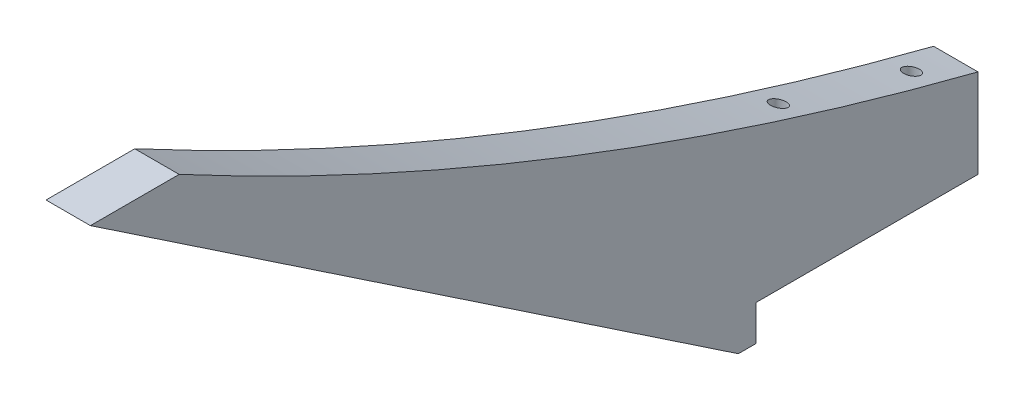
ISO-10303-21;
HEADER;
FILE_DESCRIPTION(('STEP AP214'),'2;1');
FILE_NAME('part.step','',(''),(''),'','','');
FILE_SCHEMA(('AUTOMOTIVE_DESIGN { 1 0 10303 214 1 1 1 1 }'));
ENDSEC;
DATA;
#1=APPLICATION_CONTEXT('core data for automotive mechanical design processes');
#2=APPLICATION_PROTOCOL_DEFINITION('international standard','automotive_design',2000,#1);
#3=PRODUCT_CONTEXT('',#1,'mechanical');
#4=PRODUCT('Part','Part','',(#3));
#5=PRODUCT_RELATED_PRODUCT_CATEGORY('part','',(#4));
#6=PRODUCT_DEFINITION_FORMATION('','',#4);
#7=PRODUCT_DEFINITION_CONTEXT('part definition',#1,'design');
#8=PRODUCT_DEFINITION('design','',#6,#7);
#9=PRODUCT_DEFINITION_SHAPE('','',#8);
#10=(LENGTH_UNIT() NAMED_UNIT(*) SI_UNIT(.MILLI.,.METRE.));
#11=(NAMED_UNIT(*) PLANE_ANGLE_UNIT() SI_UNIT($,.RADIAN.));
#12=(NAMED_UNIT(*) SI_UNIT($,.STERADIAN.) SOLID_ANGLE_UNIT());
#13=UNCERTAINTY_MEASURE_WITH_UNIT(LENGTH_MEASURE(1.E-05),#10,'distance_accuracy_value','');
#14=(GEOMETRIC_REPRESENTATION_CONTEXT(3) GLOBAL_UNCERTAINTY_ASSIGNED_CONTEXT((#13)) GLOBAL_UNIT_ASSIGNED_CONTEXT((#10,
#11,#12)) REPRESENTATION_CONTEXT('',''));
#15=CARTESIAN_POINT('',(0.,0.,0.));
#16=DIRECTION('',(0.,0.,1.));
#17=DIRECTION('',(1.,0.,0.));
#18=AXIS2_PLACEMENT_3D('',#15,#16,#17);
#19=CARTESIAN_POINT('',(6.35,0.,0.));
#20=DIRECTION('',(0.,1.,0.));
#21=DIRECTION('',(0.,0.,1.));
#22=AXIS2_PLACEMENT_3D('',#19,#20,#21);
#23=PLANE('',#22);
#24=CARTESIAN_POINT('',(3.175,0.,25.4));
#25=DIRECTION('',(0.,-1.,0.));
#26=DIRECTION('',(0.,0.,-1.));
#27=AXIS2_PLACEMENT_3D('',#24,#25,#26);
#28=CIRCLE('',#27,1.1303);
#29=CARTESIAN_POINT('',(3.175,0.,24.2697));
#30=VERTEX_POINT('',#29);
#31=EDGE_CURVE('E227',#30,#30,#28,.T.);
#32=ORIENTED_EDGE('',*,*,#31,.F.);
#33=EDGE_LOOP('',(#32));
#34=FACE_BOUND('',#33,.T.);
#35=CARTESIAN_POINT('',(3.175,0.,6.35));
#36=DIRECTION('',(0.,-1.,0.));
#37=DIRECTION('',(0.,0.,-1.));
#38=AXIS2_PLACEMENT_3D('',#35,#36,#37);
#39=CIRCLE('',#38,1.1303);
#40=CARTESIAN_POINT('',(3.175,0.,5.2197));
#41=VERTEX_POINT('',#40);
#42=EDGE_CURVE('E208',#41,#41,#39,.T.);
#43=ORIENTED_EDGE('',*,*,#42,.F.);
#44=EDGE_LOOP('',(#43));
#45=FACE_BOUND('',#44,.T.);
#46=DIRECTION('',(0.,0.,-1.));
#47=VECTOR('',#46,1.);
#48=CARTESIAN_POINT('',(0.,0.,0.));
#49=LINE('',#48,#47);
#50=CARTESIAN_POINT('',(0.,0.,31.75));
#51=VERTEX_POINT('',#50);
#52=CARTESIAN_POINT('',(0.,0.,0.));
#53=VERTEX_POINT('',#52);
#54=EDGE_CURVE('E149',#51,#53,#49,.T.);
#55=ORIENTED_EDGE('',*,*,#54,.T.);
#56=DIRECTION('',(-1.,0.,0.));
#57=VECTOR('',#56,1.);
#58=CARTESIAN_POINT('',(6.35,0.,0.));
#59=LINE('',#58,#57);
#60=CARTESIAN_POINT('',(6.35,0.,0.));
#61=VERTEX_POINT('',#60);
#62=EDGE_CURVE('E11',#61,#53,#59,.T.);
#63=ORIENTED_EDGE('',*,*,#62,.F.);
#64=DIRECTION('',(0.,0.,-1.));
#65=VECTOR('',#64,1.);
#66=CARTESIAN_POINT('',(6.35,0.,0.));
#67=LINE('',#66,#65);
#68=CARTESIAN_POINT('',(6.35,0.,31.75));
#69=VERTEX_POINT('',#68);
#70=EDGE_CURVE('E169',#69,#61,#67,.T.);
#71=ORIENTED_EDGE('',*,*,#70,.F.);
#72=DIRECTION('',(-1.,0.,0.));
#73=VECTOR('',#72,1.);
#74=CARTESIAN_POINT('',(6.35,0.,31.75));
#75=LINE('',#74,#73);
#76=EDGE_CURVE('E145',#69,#51,#75,.T.);
#77=ORIENTED_EDGE('',*,*,#76,.T.);
#78=EDGE_LOOP('',(#55,#63,#71,#77));
#79=FACE_BOUND('',#78,.T.);
#80=ADVANCED_FACE('F40',(#34,#45,#79),#23,.F.);
#81=CARTESIAN_POINT('',(6.35,0.,0.));
#82=DIRECTION('',(0.,0.,1.));
#83=DIRECTION('',(1.,0.,0.));
#84=AXIS2_PLACEMENT_3D('',#81,#82,#83);
#85=PLANE('',#84);
#86=DIRECTION('',(0.,1.,0.));
#87=VECTOR('',#86,1.);
#88=CARTESIAN_POINT('',(0.,0.,0.));
#89=LINE('',#88,#87);
#90=CARTESIAN_POINT('',(0.,12.7,0.));
#91=VERTEX_POINT('',#90);
#92=EDGE_CURVE('E153',#53,#91,#89,.T.);
#93=ORIENTED_EDGE('',*,*,#92,.T.);
#94=DIRECTION('',(-1.,0.,0.));
#95=VECTOR('',#94,1.);
#96=CARTESIAN_POINT('',(6.35,12.7,0.));
#97=LINE('',#96,#95);
#98=CARTESIAN_POINT('',(6.35,12.7,0.));
#99=VERTEX_POINT('',#98);
#100=EDGE_CURVE('E49',#99,#91,#97,.T.);
#101=ORIENTED_EDGE('',*,*,#100,.F.);
#102=DIRECTION('',(0.,1.,0.));
#103=VECTOR('',#102,1.);
#104=CARTESIAN_POINT('',(6.35,0.,0.));
#105=LINE('',#104,#103);
#106=EDGE_CURVE('E108',#61,#99,#105,.T.);
#107=ORIENTED_EDGE('',*,*,#106,.F.);
#108=ORIENTED_EDGE('',*,*,#62,.T.);
#109=EDGE_LOOP('',(#93,#101,#107,#108));
#110=FACE_BOUND('',#109,.T.);
#111=ADVANCED_FACE('F235',(#110),#85,.F.);
#112=CARTESIAN_POINT('',(6.35,504.92149849674,-125.626416082065));
#113=DIRECTION('',(-1.,0.,0.));
#114=DIRECTION('',(0.,0.,1.));
#115=AXIS2_PLACEMENT_3D('',#112,#113,#114);
#116=CYLINDRICAL_SURFACE('',#115,508.);
#117=CARTESIAN_POINT('',(3.175,19.5400460456678,24.2697));
#118=CARTESIAN_POINT('',(3.23639612715432,19.5400469844557,24.2697030750058));
#119=CARTESIAN_POINT('',(3.29783934554121,19.541597215755,24.2747231588741));
#120=CARTESIAN_POINT('',(3.41899634932948,19.5477484189346,24.2946392750987));
#121=CARTESIAN_POINT('',(3.47870786875294,19.5523532150549,24.3095476873962));
#122=CARTESIAN_POINT('',(3.59458670419996,19.5644456180739,24.3486873086587));
#123=CARTESIAN_POINT('',(3.6507589143203,19.5719291377724,24.3729052998872));
#124=CARTESIAN_POINT('',(3.75814103806556,19.5895274040101,24.4298357658817));
#125=CARTESIAN_POINT('',(3.80935182054985,19.599641688695,24.4625467496248));
#126=CARTESIAN_POINT('',(3.90648654511878,19.6224009539825,24.5361206253703));
#127=CARTESIAN_POINT('',(3.95229151957283,19.6350903756224,24.5771266241642));
#128=CARTESIAN_POINT('',(4.03640250990635,19.6624936311897,24.6656340754641));
#129=CARTESIAN_POINT('',(4.07470695701011,19.6772078875289,24.7131368832916));
#130=CARTESIAN_POINT('',(4.14444965569178,19.708908486545,24.8154181142534));
#131=CARTESIAN_POINT('',(4.17552998890056,19.7259645025125,24.8704189575477));
#132=CARTESIAN_POINT('',(4.22802322146617,19.7613558308319,24.9844717508056));
#133=CARTESIAN_POINT('',(4.24943402448206,19.7796914195997,25.0435245760398));
#134=CARTESIAN_POINT('',(4.28285424085325,19.8179358540818,25.1666136951452));
#135=CARTESIAN_POINT('',(4.29443875983532,19.8378784009851,25.2307550813693));
#136=CARTESIAN_POINT('',(4.30645439267016,19.8780847793138,25.3599786372956));
#137=CARTESIAN_POINT('',(4.30688370470151,19.8983486621133,25.4250609572817));
#138=CARTESIAN_POINT('',(4.29645926865756,19.9391265819884,25.5559365174312));
#139=CARTESIAN_POINT('',(4.28533996879878,19.9596352968425,25.6217104886801));
#140=CARTESIAN_POINT('',(4.25163496426418,19.9998281384269,25.7505246047472));
#141=CARTESIAN_POINT('',(4.22904891242653,20.019512240172,25.8135646667322));
#142=CARTESIAN_POINT('',(4.17305195343334,20.0573588526642,25.9346940182318));
#143=CARTESIAN_POINT('',(4.13970072660411,20.0755290730681,25.9928084224015));
#144=CARTESIAN_POINT('',(4.06291427756319,20.1098820062374,26.1026181510082));
#145=CARTESIAN_POINT('',(4.0194807245118,20.126065047309,26.1543145357962));
#146=CARTESIAN_POINT('',(3.92525917684202,20.1553780425239,26.2479095633626));
#147=CARTESIAN_POINT('',(3.87476559817445,20.1685919790607,26.2900779811955));
#148=CARTESIAN_POINT('',(3.76677063525675,20.1921568823209,26.3652512402119));
#149=CARTESIAN_POINT('',(3.70927131126085,20.2025086878281,26.3982587661218));
#150=CARTESIAN_POINT('',(3.59176801641056,20.219541947255,26.452557129099));
#151=CARTESIAN_POINT('',(3.53200344128625,20.2263712062098,26.4743198787969));
#152=CARTESIAN_POINT('',(3.40940977111788,20.236799330916,26.5075469305158));
#153=CARTESIAN_POINT('',(3.34658144702549,20.2403990049718,26.5190138094003));
#154=CARTESIAN_POINT('',(3.22213500445964,20.2441560666382,26.5309819379177));
#155=CARTESIAN_POINT('',(3.1605576343483,20.2444354408429,26.5318717840089));
#156=CARTESIAN_POINT('',(3.03814388087101,20.2418573572667,26.5236594458072));
#157=CARTESIAN_POINT('',(2.97730742762761,20.239000197652,26.5145582112896));
#158=CARTESIAN_POINT('',(2.85874370732265,20.230301467482,26.4868434579953));
#159=CARTESIAN_POINT('',(2.80099068046895,20.2244912509741,26.4683298741321));
#160=CARTESIAN_POINT('',(2.68947211590311,20.2101079170194,26.4224853151399));
#161=CARTESIAN_POINT('',(2.63570683180548,20.20153462403,26.3951537797928));
#162=CARTESIAN_POINT('',(2.53252193584346,20.1817167859637,26.3319503897877));
#163=CARTESIAN_POINT('',(2.4832074456827,20.1704234343763,26.2959224649975));
#164=CARTESIAN_POINT('',(2.39131032293476,20.1456192764607,26.2167551303329));
#165=CARTESIAN_POINT('',(2.34872886436275,20.1321080842507,26.1736144829109));
#166=CARTESIAN_POINT('',(2.26967035405138,20.1026843497833,26.0796153259484));
#167=CARTESIAN_POINT('',(2.23350684202407,20.0866972005588,26.0285165748318));
#168=CARTESIAN_POINT('',(2.17023768762965,20.053217192412,25.9214408179157));
#169=CARTESIAN_POINT('',(2.14313400843095,20.0357240081794,25.8654627581311));
#170=CARTESIAN_POINT('',(2.09753108435376,19.9989071238161,25.7475722726311));
#171=CARTESIAN_POINT('',(2.07946432852618,19.9795367104465,25.6855069789182));
#172=CARTESIAN_POINT('',(2.05414644546433,19.9402028376154,25.5593875698501));
#173=CARTESIAN_POINT('',(2.04689736992107,19.9202392663872,25.495333079573));
#174=CARTESIAN_POINT('',(2.04330729591169,19.8796501647492,25.3650080451524));
#175=CARTESIAN_POINT('',(2.0472999046309,19.8590227352566,25.2987286455948));
#176=CARTESIAN_POINT('',(2.06684227772061,19.8182813614719,25.1677264858806));
#177=CARTESIAN_POINT('',(2.08239286537524,19.7981674538638,25.1030038369518));
#178=CARTESIAN_POINT('',(2.12479190793595,19.7589793433618,24.9768188987375));
#179=CARTESIAN_POINT('',(2.15167009977313,19.7399080274097,24.9153656739764));
#180=CARTESIAN_POINT('',(2.21613265351429,19.7034457900573,24.7978011117236));
#181=CARTESIAN_POINT('',(2.25371539414706,19.6860546147229,24.7416889670075));
#182=CARTESIAN_POINT('',(2.33752114964153,19.6539586805389,24.6380762941615));
#183=CARTESIAN_POINT('',(2.38348537805544,19.6391943783038,24.5903851538279));
#184=CARTESIAN_POINT('',(2.48350084804306,19.612293988269,24.5034546818269));
#185=CARTESIAN_POINT('',(2.53755211533365,19.6001579088273,24.4642153770376));
#186=CARTESIAN_POINT('',(2.64965986668999,19.5794271850591,24.3971653869279));
#187=CARTESIAN_POINT('',(2.70743907445983,19.5707012329773,24.3689310984138));
#188=CARTESIAN_POINT('',(2.82723587853125,19.5563913642847,24.3226198358436));
#189=CARTESIAN_POINT('',(2.88924650220618,19.550802412283,24.3045265838552));
#190=CARTESIAN_POINT('',(2.98897023558641,19.5446128887764,24.2844873606096));
#191=CARTESIAN_POINT('',(3.02593178733565,19.5429029026555,24.2789505802527));
#192=CARTESIAN_POINT('',(3.10025641283926,19.5406192069743,24.2715560016033));
#193=CARTESIAN_POINT('',(3.1376194783375,19.5400454740946,24.2696981278083));
#194=CARTESIAN_POINT('',(3.175,19.5400460456678,24.2697));
#195=B_SPLINE_CURVE_WITH_KNOTS('',3,(#117,#118,#119,#120,#121,#122,#123,#124,#125,#126,#127,
#128,#129,#130,#131,#132,#133,#134,#135,#136,#137,#138,#139,#140,#141,#142,#143,#144,#145,#146,
#147,#148,#149,#150,#151,#152,#153,#154,#155,#156,#157,#158,#159,#160,#161,#162,#163,#164,#165,
#166,#167,#168,#169,#170,#171,#172,#173,#174,#175,#176,#177,#178,#179,#180,#181,#182,#183,#184,
#185,#186,#187,#188,#189,#190,#191,#192,#193,#194),.UNSPECIFIED.,.T.,.F.,(4,2,2,2,2,2,2,2,2,2,2,
2,2,2,2,2,2,2,2,2,2,2,2,2,2,2,2,2,2,2,2,2,2,2,2,2,2,2,4),(0.,0.184048414185326,
0.368327688449311,0.552346283710007,0.736332594636358,0.92381542308732,1.11133742279507,
1.30677193780733,1.50224880243991,1.7058005553657,1.90938518635759,2.1177569880971,
2.32613509877669,2.5333772851977,2.7405851864718,2.94086578110053,3.14108761859889,
3.33203484183101,3.52293426121778,3.70679744963743,3.89064316111017,4.07257644573625,
4.25452129114449,4.4400122773379,4.6255355713638,4.81850383656876,5.01151388885793,
5.21304133639889,5.4146070009618,5.6222168047622,5.82984139819311,6.03801447122041,
6.24615603187752,6.44871483426272,6.65127428080113,6.84500446948417,7.0384227940894,
7.15048144097626,7.26253778805025),.UNSPECIFIED.);
#196=CARTESIAN_POINT('',(3.175,19.5400460456678,24.2697));
#197=VERTEX_POINT('',#196);
#198=EDGE_CURVE('E221',#197,#197,#195,.T.);
#199=ORIENTED_EDGE('',*,*,#198,.T.);
#200=EDGE_LOOP('',(#199));
#201=FACE_BOUND('',#200,.T.);
#202=CARTESIAN_POINT('',(3.175,14.0617487654759,5.2197));
#203=CARTESIAN_POINT('',(3.23690057272921,14.0617495569643,5.21970300970408));
#204=CARTESIAN_POINT('',(3.29884768457934,14.0631095000981,5.22480502808711));
#205=CARTESIAN_POINT('',(3.42100756923234,14.0685084081811,5.24505608193283));
#206=CARTESIAN_POINT('',(3.48121810812846,14.0725506761245,5.26021750446593));
#207=CARTESIAN_POINT('',(3.59808608436089,14.0831755988751,5.30005640004546));
#208=CARTESIAN_POINT('',(3.65474765254499,14.0897552339303,5.32472256135697));
#209=CARTESIAN_POINT('',(3.763047127071,14.1052429175371,5.38275976790347));
#210=CARTESIAN_POINT('',(3.81468599173074,14.1141505207184,5.41612914809795));
#211=CARTESIAN_POINT('',(3.91235141887627,14.1341693689653,5.4910849985657));
#212=CARTESIAN_POINT('',(3.95828523965912,14.1453108324132,5.53278411648381));
#213=CARTESIAN_POINT('',(4.04253033465856,14.1693849625917,5.6228324142384));
#214=CARTESIAN_POINT('',(4.08084028898979,14.1823179388226,5.67118274312255));
#215=CARTESIAN_POINT('',(4.15005462708717,14.2100532945516,5.77480350962014));
#216=CARTESIAN_POINT('',(4.1806830961406,14.2249022206149,5.83024576622999));
#217=CARTESIAN_POINT('',(4.23220395803113,14.2557113887389,5.94519522412296));
#218=CARTESIAN_POINT('',(4.25309471595095,14.2716718168991,6.00470310608441));
#219=CARTESIAN_POINT('',(4.28518725935417,14.3047869115674,6.12807725439285));
#220=CARTESIAN_POINT('',(4.29606720945369,14.321963287339,6.19202152792154));
#221=CARTESIAN_POINT('',(4.30676717000689,14.3565727561107,6.32076303734384));
#222=CARTESIAN_POINT('',(4.30658584496782,14.3740058798555,6.38556037528869));
#223=CARTESIAN_POINT('',(4.29506832390168,14.4089534364889,6.51535525574793));
#224=CARTESIAN_POINT('',(4.28353883083692,14.4264640410311,6.58033680039782));
#225=CARTESIAN_POINT('',(4.24929646849296,14.4607547322366,6.70749175964045));
#226=CARTESIAN_POINT('',(4.22658340058628,14.4775348059195,6.76966512433669));
#227=CARTESIAN_POINT('',(4.17063643743311,14.5097882324331,6.88908582953057));
#228=CARTESIAN_POINT('',(4.13745183693324,14.5252672860117,6.94635468379726));
#229=CARTESIAN_POINT('',(4.0613477046095,14.554518959794,7.05451141830854));
#230=CARTESIAN_POINT('',(4.01842937915303,14.5682917911348,7.10540008808061));
#231=CARTESIAN_POINT('',(3.92520522259195,14.5933458566596,7.19792270019034));
#232=CARTESIAN_POINT('',(3.87511537347115,14.6046816133976,7.23975933411294));
#233=CARTESIAN_POINT('',(3.76814663976187,14.6249049920714,7.31436734068615));
#234=CARTESIAN_POINT('',(3.71126919910986,14.6337931333668,7.34714063649316));
#235=CARTESIAN_POINT('',(3.59447641112246,14.6485354979603,7.40148520642644));
#236=CARTESIAN_POINT('',(3.53473631148393,14.654484761056,7.42340744607079));
#237=CARTESIAN_POINT('',(3.41222825818783,14.6635880382149,7.45694703504145));
#238=CARTESIAN_POINT('',(3.34946086715141,14.6667425695834,7.46856629145215));
#239=CARTESIAN_POINT('',(3.22455531011622,14.670093136199,7.48090746400686));
#240=CARTESIAN_POINT('',(3.16244815987886,14.6703689787825,7.48192334304059));
#241=CARTESIAN_POINT('',(3.03895668075853,14.6681601110013,7.47378759560287));
#242=CARTESIAN_POINT('',(2.9775722988366,14.6656756044915,7.46463671995804));
#243=CARTESIAN_POINT('',(2.85776455607114,14.658064737926,7.43659803300875));
#244=CARTESIAN_POINT('',(2.79932150772746,14.6529595741597,7.4177883433241));
#245=CARTESIAN_POINT('',(2.68646832569865,14.640292060621,7.37109967379335));
#246=CARTESIAN_POINT('',(2.63205838702616,14.6327295921258,7.34322025575017));
#247=CARTESIAN_POINT('',(2.52791923228866,14.6152627625876,7.27879948907912));
#248=CARTESIAN_POINT('',(2.47827096485654,14.6053254802082,7.24213635468706));
#249=CARTESIAN_POINT('',(2.38581897054209,14.583481866386,7.16150199905469));
#250=CARTESIAN_POINT('',(2.34301618177295,14.5715752655193,7.11752977784874));
#251=CARTESIAN_POINT('',(2.26406316348995,14.5457519323655,7.02210329749998));
#252=CARTESIAN_POINT('',(2.22815614641266,14.5317848990378,6.97046148658035));
#253=CARTESIAN_POINT('',(2.16549355572164,14.5025348097115,6.86223700492339));
#254=CARTESIAN_POINT('',(2.13873953392278,14.4872515311035,6.8056534984016));
#255=CARTESIAN_POINT('',(2.0942298114499,14.4552603933827,6.6871250568186));
#256=CARTESIAN_POINT('',(2.07680461955633,14.4385219982384,6.62506415487691));
#257=CARTESIAN_POINT('',(2.05272940740905,14.404552108804,6.49901511012122));
#258=CARTESIAN_POINT('',(2.04608094432372,14.3873205436199,6.43502669015356));
#259=CARTESIAN_POINT('',(2.04368049453288,14.3524462801134,6.30542089459344));
#260=CARTESIAN_POINT('',(2.04817450899918,14.3348029731528,6.23979898169199));
#261=CARTESIAN_POINT('',(2.06848489873646,14.2999854829773,6.11019793407714));
#262=CARTESIAN_POINT('',(2.08430182717768,14.2828113227247,6.04621887978222));
#263=CARTESIAN_POINT('',(2.12693333669743,14.2494011369542,5.92166272624584));
#264=CARTESIAN_POINT('',(2.15376306365067,14.2331664386999,5.86109044329442));
#265=CARTESIAN_POINT('',(2.21778162563413,14.2021477206571,5.74527938892978));
#266=CARTESIAN_POINT('',(2.25496915873165,14.1873635188627,5.69003994837503));
#267=CARTESIAN_POINT('',(2.33788255372978,14.1599972001657,5.58772796142958));
#268=CARTESIAN_POINT('',(2.38341642624199,14.1473759437122,5.5405104319468));
#269=CARTESIAN_POINT('',(2.48230737253038,14.124377044299,5.45442754040947));
#270=CARTESIAN_POINT('',(2.53566499422305,14.1139995586022,5.41556276378927));
#271=CARTESIAN_POINT('',(2.64679941365094,14.0961458352466,5.34867448054489));
#272=CARTESIAN_POINT('',(2.70437466803324,14.0885858285108,5.3203380414971));
#273=CARTESIAN_POINT('',(2.82369184746745,14.0761672719424,5.27378025806842));
#274=CARTESIAN_POINT('',(2.8854274110681,14.071304698108,5.25554384663948));
#275=CARTESIAN_POINT('',(2.9855317267343,14.0658387311,5.23504246388594));
#276=CARTESIAN_POINT('',(3.0231729394026,14.0643072052693,5.22929748573932));
#277=CARTESIAN_POINT('',(3.09887023706082,14.0622619874759,5.22162535982344));
#278=CARTESIAN_POINT('',(3.13692631516627,14.0617482786488,5.21969814879703));
#279=CARTESIAN_POINT('',(3.175,14.0617487654759,5.2197));
#280=B_SPLINE_CURVE_WITH_KNOTS('',3,(#202,#203,#204,#205,#206,#207,#208,#209,#210,#211,#212,
#213,#214,#215,#216,#217,#218,#219,#220,#221,#222,#223,#224,#225,#226,#227,#228,#229,#230,#231,
#232,#233,#234,#235,#236,#237,#238,#239,#240,#241,#242,#243,#244,#245,#246,#247,#248,#249,#250,
#251,#252,#253,#254,#255,#256,#257,#258,#259,#260,#261,#262,#263,#264,#265,#266,#267,#268,#269,
#270,#271,#272,#273,#274,#275,#276,#277,#278,#279),.UNSPECIFIED.,.T.,.F.,(4,2,2,2,2,2,2,2,2,2,2,
2,2,2,2,2,2,2,2,2,2,2,2,2,2,2,2,2,2,2,2,2,2,2,2,2,2,2,4),(0.,0.185560107845002,
0.371349138066134,0.556917737441287,0.742450861105251,0.930687418985726,1.11895653710984,
1.31324467145946,1.50756541416141,1.70793488276576,1.90832854320165,2.11219570127761,
2.31606648029617,2.51899150588511,2.72189139531207,2.91962384418203,3.11731430380854,
3.30810684854869,3.49886407017167,3.68431830325068,3.86975884122969,4.05372260080677,
4.23769524977451,4.42438355593017,4.61109742420902,4.80351598140588,4.99596714543432,
5.19484830413082,5.39375819732186,5.59709851257976,5.80044876251426,6.00407962160763,
6.20768489669983,6.40708945605989,6.60650798688998,6.799405997613,6.99201546591663,
7.1061513101511,7.22028526323599),.UNSPECIFIED.);
#281=CARTESIAN_POINT('',(3.175,14.0617487654759,5.2197));
#282=VERTEX_POINT('',#281);
#283=EDGE_CURVE('E154',#282,#282,#280,.T.);
#284=ORIENTED_EDGE('',*,*,#283,.T.);
#285=EDGE_LOOP('',(#284));
#286=FACE_BOUND('',#285,.T.);
#287=CARTESIAN_POINT('',(0.,504.92149849674,-125.626416082065));
#288=DIRECTION('',(-1.,0.,0.));
#289=DIRECTION('',(0.,0.,-1.));
#290=AXIS2_PLACEMENT_3D('',#287,#288,#289);
#291=CIRCLE('',#290,508.);
#292=CARTESIAN_POINT('',(0.,57.15,114.3));
#293=VERTEX_POINT('',#292);
#294=EDGE_CURVE('E157',#91,#293,#291,.T.);
#295=ORIENTED_EDGE('',*,*,#294,.T.);
#296=DIRECTION('',(-1.,0.,0.));
#297=VECTOR('',#296,1.);
#298=CARTESIAN_POINT('',(6.35,57.15,114.3));
#299=LINE('',#298,#297);
#300=CARTESIAN_POINT('',(6.35,57.15,114.3));
#301=VERTEX_POINT('',#300);
#302=EDGE_CURVE('E176',#301,#293,#299,.T.);
#303=ORIENTED_EDGE('',*,*,#302,.F.);
#304=CARTESIAN_POINT('',(6.35,504.92149849674,-125.626416082065));
#305=DIRECTION('',(-1.,0.,0.));
#306=DIRECTION('',(0.,0.,-1.));
#307=AXIS2_PLACEMENT_3D('',#304,#305,#306);
#308=CIRCLE('',#307,508.);
#309=EDGE_CURVE('E186',#99,#301,#308,.T.);
#310=ORIENTED_EDGE('',*,*,#309,.F.);
#311=ORIENTED_EDGE('',*,*,#100,.T.);
#312=EDGE_LOOP('',(#295,#303,#310,#311));
#313=FACE_BOUND('',#312,.T.);
#314=ADVANCED_FACE('F184',(#201,#286,#313),#116,.F.);
#315=CARTESIAN_POINT('',(6.35,57.15,127.));
#316=DIRECTION('',(0.,-1.,0.));
#317=DIRECTION('',(0.,0.,-1.));
#318=AXIS2_PLACEMENT_3D('',#315,#316,#317);
#319=PLANE('',#318);
#320=DIRECTION('',(0.,0.,1.));
#321=VECTOR('',#320,1.);
#322=CARTESIAN_POINT('',(0.,57.15,127.));
#323=LINE('',#322,#321);
#324=CARTESIAN_POINT('',(0.,57.15,127.));
#325=VERTEX_POINT('',#324);
#326=EDGE_CURVE('E160',#293,#325,#323,.T.);
#327=ORIENTED_EDGE('',*,*,#326,.T.);
#328=DIRECTION('',(-1.,0.,0.));
#329=VECTOR('',#328,1.);
#330=CARTESIAN_POINT('',(6.35,57.15,127.));
#331=LINE('',#330,#329);
#332=CARTESIAN_POINT('',(6.35,57.15,127.));
#333=VERTEX_POINT('',#332);
#334=EDGE_CURVE('E138',#333,#325,#331,.T.);
#335=ORIENTED_EDGE('',*,*,#334,.F.);
#336=DIRECTION('',(0.,0.,1.));
#337=VECTOR('',#336,1.);
#338=CARTESIAN_POINT('',(6.35,57.15,127.));
#339=LINE('',#338,#337);
#340=EDGE_CURVE('E127',#301,#333,#339,.T.);
#341=ORIENTED_EDGE('',*,*,#340,.F.);
#342=ORIENTED_EDGE('',*,*,#302,.T.);
#343=EDGE_LOOP('',(#327,#335,#341,#342));
#344=FACE_BOUND('',#343,.T.);
#345=ADVANCED_FACE('F192',(#344),#319,.F.);
#346=CARTESIAN_POINT('',(6.35,-5.08,34.29));
#347=DIRECTION('',(0.,0.830296320178178,-0.557322187516859));
#348=DIRECTION('',(0.,0.557322187516859,0.830296320178178));
#349=AXIS2_PLACEMENT_3D('',#346,#347,#348);
#350=PLANE('',#349);
#351=DIRECTION('',(0.,-0.557322187516859,-0.830296320178178));
#352=VECTOR('',#351,1.);
#353=CARTESIAN_POINT('',(0.,-5.08,34.29));
#354=LINE('',#353,#352);
#355=CARTESIAN_POINT('',(0.,-5.08,34.29));
#356=VERTEX_POINT('',#355);
#357=EDGE_CURVE('E136',#325,#356,#354,.T.);
#358=ORIENTED_EDGE('',*,*,#357,.T.);
#359=DIRECTION('',(-1.,0.,0.));
#360=VECTOR('',#359,1.);
#361=CARTESIAN_POINT('',(6.35,-5.08,34.29));
#362=LINE('',#361,#360);
#363=CARTESIAN_POINT('',(6.35,-5.08,34.29));
#364=VERTEX_POINT('',#363);
#365=EDGE_CURVE('E133',#364,#356,#362,.T.);
#366=ORIENTED_EDGE('',*,*,#365,.F.);
#367=DIRECTION('',(0.,-0.557322187516859,-0.830296320178178));
#368=VECTOR('',#367,1.);
#369=CARTESIAN_POINT('',(6.35,-5.08,34.29));
#370=LINE('',#369,#368);
#371=EDGE_CURVE('E121',#333,#364,#370,.T.);
#372=ORIENTED_EDGE('',*,*,#371,.F.);
#373=ORIENTED_EDGE('',*,*,#334,.T.);
#374=EDGE_LOOP('',(#358,#366,#372,#373));
#375=FACE_BOUND('',#374,.T.);
#376=ADVANCED_FACE('F134',(#375),#350,.F.);
#377=CARTESIAN_POINT('',(6.35,-5.08,31.75));
#378=DIRECTION('',(0.,1.,0.));
#379=DIRECTION('',(0.,0.,1.));
#380=AXIS2_PLACEMENT_3D('',#377,#378,#379);
#381=PLANE('',#380);
#382=DIRECTION('',(0.,0.,-1.));
#383=VECTOR('',#382,1.);
#384=CARTESIAN_POINT('',(0.,-5.08,31.75));
#385=LINE('',#384,#383);
#386=CARTESIAN_POINT('',(0.,-5.08,31.75));
#387=VERTEX_POINT('',#386);
#388=EDGE_CURVE('E92',#356,#387,#385,.T.);
#389=ORIENTED_EDGE('',*,*,#388,.T.);
#390=DIRECTION('',(-1.,0.,0.));
#391=VECTOR('',#390,1.);
#392=CARTESIAN_POINT('',(6.35,-5.08,31.75));
#393=LINE('',#392,#391);
#394=CARTESIAN_POINT('',(6.35,-5.08,31.75));
#395=VERTEX_POINT('',#394);
#396=EDGE_CURVE('E139',#395,#387,#393,.T.);
#397=ORIENTED_EDGE('',*,*,#396,.F.);
#398=DIRECTION('',(0.,0.,-1.));
#399=VECTOR('',#398,1.);
#400=CARTESIAN_POINT('',(6.35,-5.08,31.75));
#401=LINE('',#400,#399);
#402=EDGE_CURVE('E125',#364,#395,#401,.T.);
#403=ORIENTED_EDGE('',*,*,#402,.F.);
#404=ORIENTED_EDGE('',*,*,#365,.T.);
#405=EDGE_LOOP('',(#389,#397,#403,#404));
#406=FACE_BOUND('',#405,.T.);
#407=ADVANCED_FACE('F141',(#406),#381,.F.);
#408=CARTESIAN_POINT('',(6.35,0.,31.75));
#409=DIRECTION('',(0.,0.,1.));
#410=DIRECTION('',(1.,0.,0.));
#411=AXIS2_PLACEMENT_3D('',#408,#409,#410);
#412=PLANE('',#411);
#413=DIRECTION('',(0.,1.,0.));
#414=VECTOR('',#413,1.);
#415=CARTESIAN_POINT('',(0.,0.,31.75));
#416=LINE('',#415,#414);
#417=EDGE_CURVE('E98',#387,#51,#416,.T.);
#418=ORIENTED_EDGE('',*,*,#417,.T.);
#419=ORIENTED_EDGE('',*,*,#76,.F.);
#420=DIRECTION('',(0.,1.,0.));
#421=VECTOR('',#420,1.);
#422=CARTESIAN_POINT('',(6.35,0.,31.75));
#423=LINE('',#422,#421);
#424=EDGE_CURVE('E60',#395,#69,#423,.T.);
#425=ORIENTED_EDGE('',*,*,#424,.F.);
#426=ORIENTED_EDGE('',*,*,#396,.T.);
#427=EDGE_LOOP('',(#418,#419,#425,#426));
#428=FACE_BOUND('',#427,.T.);
#429=ADVANCED_FACE('F241',(#428),#412,.F.);
#430=CARTESIAN_POINT('',(6.35,504.92149849674,-125.626416082065));
#431=DIRECTION('',(1.,0.,0.));
#432=DIRECTION('',(0.,0.,-1.));
#433=AXIS2_PLACEMENT_3D('',#430,#431,#432);
#434=PLANE('',#433);
#435=ORIENTED_EDGE('',*,*,#70,.T.);
#436=ORIENTED_EDGE('',*,*,#106,.T.);
#437=ORIENTED_EDGE('',*,*,#309,.T.);
#438=ORIENTED_EDGE('',*,*,#340,.T.);
#439=ORIENTED_EDGE('',*,*,#371,.T.);
#440=ORIENTED_EDGE('',*,*,#402,.T.);
#441=ORIENTED_EDGE('',*,*,#424,.T.);
#442=EDGE_LOOP('',(#435,#436,#437,#438,#439,#440,#441));
#443=FACE_BOUND('',#442,.T.);
#444=ADVANCED_FACE('F123',(#443),#434,.T.);
#445=CARTESIAN_POINT('',(0.,504.92149849674,-125.626416082065));
#446=DIRECTION('',(1.,0.,0.));
#447=DIRECTION('',(0.,0.,-1.));
#448=AXIS2_PLACEMENT_3D('',#445,#446,#447);
#449=PLANE('',#448);
#450=ORIENTED_EDGE('',*,*,#54,.F.);
#451=ORIENTED_EDGE('',*,*,#417,.F.);
#452=ORIENTED_EDGE('',*,*,#388,.F.);
#453=ORIENTED_EDGE('',*,*,#357,.F.);
#454=ORIENTED_EDGE('',*,*,#326,.F.);
#455=ORIENTED_EDGE('',*,*,#294,.F.);
#456=ORIENTED_EDGE('',*,*,#92,.F.);
#457=EDGE_LOOP('',(#450,#451,#452,#453,#454,#455,#456));
#458=FACE_BOUND('',#457,.T.);
#459=ADVANCED_FACE('F190',(#458),#449,.F.);
#460=CARTESIAN_POINT('',(3.175,0.,6.35));
#461=DIRECTION('',(0.,-1.,0.));
#462=DIRECTION('',(0.,0.,-1.));
#463=AXIS2_PLACEMENT_3D('',#460,#461,#462);
#464=CYLINDRICAL_SURFACE('',#463,1.13029999999999);
#465=ORIENTED_EDGE('',*,*,#283,.F.);
#466=EDGE_LOOP('',(#465));
#467=FACE_BOUND('',#466,.T.);
#468=ORIENTED_EDGE('',*,*,#42,.T.);
#469=EDGE_LOOP('',(#468));
#470=FACE_BOUND('',#469,.T.);
#471=ADVANCED_FACE('F212',(#467,#470),#464,.F.);
#472=CARTESIAN_POINT('',(3.175,0.,25.4));
#473=DIRECTION('',(0.,-1.,0.));
#474=DIRECTION('',(0.,0.,-1.));
#475=AXIS2_PLACEMENT_3D('',#472,#473,#474);
#476=CYLINDRICAL_SURFACE('',#475,1.13029999999999);
#477=ORIENTED_EDGE('',*,*,#198,.F.);
#478=EDGE_LOOP('',(#477));
#479=FACE_BOUND('',#478,.T.);
#480=ORIENTED_EDGE('',*,*,#31,.T.);
#481=EDGE_LOOP('',(#480));
#482=FACE_BOUND('',#481,.T.);
#483=ADVANCED_FACE('F216',(#479,#482),#476,.F.);
#484=CLOSED_SHELL('',(#80,#111,#314,#345,#376,#407,#429,#444,#459,#471,#483));
#485=MANIFOLD_SOLID_BREP('B2',#484);
#486=ADVANCED_BREP_SHAPE_REPRESENTATION('',(#18,#485),#14);
#487=SHAPE_DEFINITION_REPRESENTATION(#9,#486);
ENDSEC;
END-ISO-10303-21;
